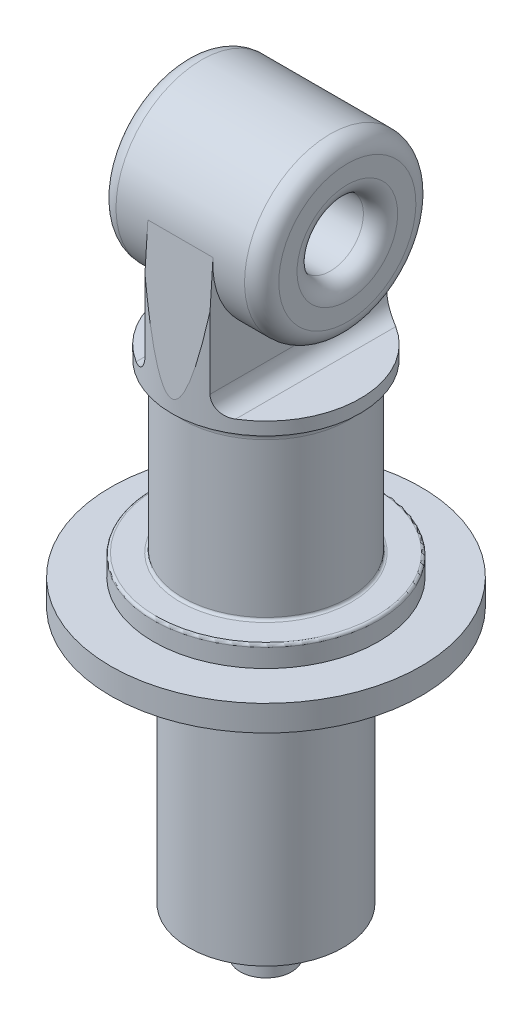
ISO-10303-21;
HEADER;
FILE_DESCRIPTION(('STEP AP214'),'2;1');
FILE_NAME('part.step','',(''),(''),'','','');
FILE_SCHEMA(('AUTOMOTIVE_DESIGN { 1 0 10303 214 1 1 1 1 }'));
ENDSEC;
DATA;
#1=APPLICATION_CONTEXT('core data for automotive mechanical design processes');
#2=APPLICATION_PROTOCOL_DEFINITION('international standard','automotive_design',2000,#1);
#3=PRODUCT_CONTEXT('',#1,'mechanical');
#4=PRODUCT('Part','Part','',(#3));
#5=PRODUCT_RELATED_PRODUCT_CATEGORY('part','',(#4));
#6=PRODUCT_DEFINITION_FORMATION('','',#4);
#7=PRODUCT_DEFINITION_CONTEXT('part definition',#1,'design');
#8=PRODUCT_DEFINITION('design','',#6,#7);
#9=PRODUCT_DEFINITION_SHAPE('','',#8);
#10=(LENGTH_UNIT() NAMED_UNIT(*) SI_UNIT(.MILLI.,.METRE.));
#11=(NAMED_UNIT(*) PLANE_ANGLE_UNIT() SI_UNIT($,.RADIAN.));
#12=(NAMED_UNIT(*) SI_UNIT($,.STERADIAN.) SOLID_ANGLE_UNIT());
#13=UNCERTAINTY_MEASURE_WITH_UNIT(LENGTH_MEASURE(1.E-05),#10,'distance_accuracy_value','');
#14=(GEOMETRIC_REPRESENTATION_CONTEXT(3) GLOBAL_UNCERTAINTY_ASSIGNED_CONTEXT((#13)) GLOBAL_UNIT_ASSIGNED_CONTEXT((#10,
#11,#12)) REPRESENTATION_CONTEXT('',''));
#15=CARTESIAN_POINT('',(0.,0.,0.));
#16=DIRECTION('',(0.,0.,1.));
#17=DIRECTION('',(1.,0.,0.));
#18=AXIS2_PLACEMENT_3D('',#15,#16,#17);
#19=CARTESIAN_POINT('',(6.35,19.8769042879992,12.6730513018171));
#20=DIRECTION('',(0.,-0.0651105738582061,-0.99787805526119));
#21=DIRECTION('',(0.,0.99787805526119,-0.0651105738582061));
#22=AXIS2_PLACEMENT_3D('',#19,#20,#21);
#23=PLANE('',#22);
#24=DIRECTION('',(0.,-0.99787805526119,0.0651105738582061));
#25=VECTOR('',#24,1.);
#26=CARTESIAN_POINT('',(-4.826,19.8769042879992,12.6730513018171));
#27=LINE('',#26,#25);
#28=CARTESIAN_POINT('',(-4.826,19.8769042879992,12.6730513018171));
#29=VERTEX_POINT('',#28);
#30=CARTESIAN_POINT('',(-4.826,13.1811355705445,13.109943706973));
#31=VERTEX_POINT('',#30);
#32=EDGE_CURVE('E11',#29,#31,#27,.T.);
#33=ORIENTED_EDGE('',*,*,#32,.T.);
#34=CARTESIAN_POINT('',(0.,214.102803983225,0.));
#35=DIRECTION('',(0.,-0.0651105738582061,-0.99787805526119));
#36=DIRECTION('',(0.,-0.99787805526119,0.0651105738582061));
#37=AXIS2_PLACEMENT_3D('',#34,#35,#36);
#38=ELLIPSE('',#37,214.558084381548,13.97);
#39=CARTESIAN_POINT('',(4.826,13.1811355705445,13.109943706973));
#40=VERTEX_POINT('',#39);
#41=EDGE_CURVE('E36',#40,#31,#38,.T.);
#42=ORIENTED_EDGE('',*,*,#41,.F.);
#43=DIRECTION('',(0.,0.99787805526119,-0.0651105738582061));
#44=VECTOR('',#43,1.);
#45=CARTESIAN_POINT('',(4.826,19.8769042879992,12.6730513018171));
#46=LINE('',#45,#44);
#47=CARTESIAN_POINT('',(4.826,19.8769042879992,12.6730513018171));
#48=VERTEX_POINT('',#47);
#49=EDGE_CURVE('E27',#40,#48,#46,.T.);
#50=ORIENTED_EDGE('',*,*,#49,.T.);
#51=DIRECTION('',(-1.,0.,0.));
#52=VECTOR('',#51,1.);
#53=CARTESIAN_POINT('',(4.826,19.8769042879992,12.6730513018171));
#54=LINE('',#53,#52);
#55=EDGE_CURVE('E122',#48,#29,#54,.T.);
#56=ORIENTED_EDGE('',*,*,#55,.T.);
#57=EDGE_LOOP('',(#33,#42,#50,#56));
#58=FACE_BOUND('',#57,.T.);
#59=ADVANCED_FACE('F16',(#58),#23,.F.);
#60=CARTESIAN_POINT('',(6.35,0.,-13.97));
#61=DIRECTION('',(0.,-0.0651105738582063,0.99787805526119));
#62=DIRECTION('',(0.,-0.99787805526119,-0.0651105738582063));
#63=AXIS2_PLACEMENT_3D('',#60,#61,#62);
#64=PLANE('',#63);
#65=DIRECTION('',(0.,-0.99787805526119,-0.0651105738582063));
#66=VECTOR('',#65,1.);
#67=CARTESIAN_POINT('',(4.826,0.,-13.97));
#68=LINE('',#67,#66);
#69=CARTESIAN_POINT('',(4.826,19.8769042879992,-12.6730513018171));
#70=VERTEX_POINT('',#69);
#71=CARTESIAN_POINT('',(4.826,13.1811355705446,-13.109943706973));
#72=VERTEX_POINT('',#71);
#73=EDGE_CURVE('E123',#70,#72,#68,.T.);
#74=ORIENTED_EDGE('',*,*,#73,.T.);
#75=CARTESIAN_POINT('',(0.,214.102803983225,0.));
#76=DIRECTION('',(0.,-0.0651105738582063,0.99787805526119));
#77=DIRECTION('',(0.,-0.99787805526119,-0.0651105738582063));
#78=AXIS2_PLACEMENT_3D('',#75,#76,#77);
#79=ELLIPSE('',#78,214.558084381547,13.97);
#80=CARTESIAN_POINT('',(-4.826,13.1811355705446,-13.109943706973));
#81=VERTEX_POINT('',#80);
#82=EDGE_CURVE('E468',#81,#72,#79,.T.);
#83=ORIENTED_EDGE('',*,*,#82,.F.);
#84=DIRECTION('',(0.,0.99787805526119,0.0651105738582063));
#85=VECTOR('',#84,1.);
#86=CARTESIAN_POINT('',(-4.826,0.,-13.97));
#87=LINE('',#86,#85);
#88=CARTESIAN_POINT('',(-4.826,19.8769042879992,-12.6730513018171));
#89=VERTEX_POINT('',#88);
#90=EDGE_CURVE('E115',#81,#89,#87,.T.);
#91=ORIENTED_EDGE('',*,*,#90,.T.);
#92=DIRECTION('',(-1.,0.,0.));
#93=VECTOR('',#92,1.);
#94=CARTESIAN_POINT('',(4.826,19.8769042879992,-12.6730513018171));
#95=LINE('',#94,#93);
#96=EDGE_CURVE('E132',#70,#89,#95,.T.);
#97=ORIENTED_EDGE('',*,*,#96,.F.);
#98=EDGE_LOOP('',(#74,#83,#91,#97));
#99=FACE_BOUND('',#98,.T.);
#100=ADVANCED_FACE('F235',(#99),#64,.F.);
#101=CARTESIAN_POINT('',(4.826,0.,0.));
#102=DIRECTION('',(-1.,0.,0.));
#103=DIRECTION('',(0.,0.,1.));
#104=AXIS2_PLACEMENT_3D('',#101,#102,#103);
#105=PLANE('',#104);
#106=DIRECTION('',(0.,-1.,0.));
#107=VECTOR('',#106,1.);
#108=CARTESIAN_POINT('',(4.826,15.748,13.109943706973));
#109=LINE('',#108,#107);
#110=CARTESIAN_POINT('',(4.826,2.54,13.109943706973));
#111=VERTEX_POINT('',#110);
#112=EDGE_CURVE('E140',#111,#40,#109,.F.);
#113=ORIENTED_EDGE('',*,*,#112,.F.);
#114=DIRECTION('',(0.,0.,-1.));
#115=VECTOR('',#114,1.);
#116=CARTESIAN_POINT('',(4.826,2.54,-13.109943706973));
#117=LINE('',#116,#115);
#118=CARTESIAN_POINT('',(4.826,2.54,-13.109943706973));
#119=VERTEX_POINT('',#118);
#120=EDGE_CURVE('E113',#111,#119,#117,.T.);
#121=ORIENTED_EDGE('',*,*,#120,.T.);
#122=DIRECTION('',(0.,-1.,0.));
#123=VECTOR('',#122,1.);
#124=CARTESIAN_POINT('',(4.826,15.748,-13.109943706973));
#125=LINE('',#124,#123);
#126=EDGE_CURVE('E91',#72,#119,#125,.T.);
#127=ORIENTED_EDGE('',*,*,#126,.F.);
#128=ORIENTED_EDGE('',*,*,#73,.F.);
#129=CARTESIAN_POINT('',(4.826,19.05,0.));
#130=DIRECTION('',(-1.,0.,0.));
#131=DIRECTION('',(0.,0.,1.));
#132=AXIS2_PLACEMENT_3D('',#129,#130,#131);
#133=CIRCLE('',#132,12.7);
#134=EDGE_CURVE('E100',#48,#70,#133,.F.);
#135=ORIENTED_EDGE('',*,*,#134,.F.);
#136=ORIENTED_EDGE('',*,*,#49,.F.);
#137=EDGE_LOOP('',(#113,#121,#127,#128,#135,#136));
#138=FACE_BOUND('',#137,.T.);
#139=ADVANCED_FACE('F241',(#138),#105,.F.);
#140=CARTESIAN_POINT('',(-4.826,0.,0.));
#141=DIRECTION('',(1.,0.,0.));
#142=DIRECTION('',(0.,0.,-1.));
#143=AXIS2_PLACEMENT_3D('',#140,#141,#142);
#144=PLANE('',#143);
#145=DIRECTION('',(0.,-1.,0.));
#146=VECTOR('',#145,1.);
#147=CARTESIAN_POINT('',(-4.826,15.748,-13.109943706973));
#148=LINE('',#147,#146);
#149=CARTESIAN_POINT('',(-4.826,2.54,-13.109943706973));
#150=VERTEX_POINT('',#149);
#151=EDGE_CURVE('E474',#150,#81,#148,.F.);
#152=ORIENTED_EDGE('',*,*,#151,.F.);
#153=DIRECTION('',(0.,0.,1.));
#154=VECTOR('',#153,1.);
#155=CARTESIAN_POINT('',(-4.826,2.54,13.109943706973));
#156=LINE('',#155,#154);
#157=CARTESIAN_POINT('',(-4.826,2.54,13.109943706973));
#158=VERTEX_POINT('',#157);
#159=EDGE_CURVE('E116',#150,#158,#156,.T.);
#160=ORIENTED_EDGE('',*,*,#159,.T.);
#161=DIRECTION('',(0.,-1.,0.));
#162=VECTOR('',#161,1.);
#163=CARTESIAN_POINT('',(-4.826,15.748,13.109943706973));
#164=LINE('',#163,#162);
#165=EDGE_CURVE('E472',#31,#158,#164,.T.);
#166=ORIENTED_EDGE('',*,*,#165,.F.);
#167=ORIENTED_EDGE('',*,*,#32,.F.);
#168=CARTESIAN_POINT('',(-4.826,19.05,0.));
#169=DIRECTION('',(1.,0.,0.));
#170=DIRECTION('',(0.,0.,-1.));
#171=AXIS2_PLACEMENT_3D('',#168,#169,#170);
#172=CIRCLE('',#171,12.7);
#173=EDGE_CURVE('E118',#29,#89,#172,.T.);
#174=ORIENTED_EDGE('',*,*,#173,.T.);
#175=ORIENTED_EDGE('',*,*,#90,.F.);
#176=EDGE_LOOP('',(#152,#160,#166,#167,#174,#175));
#177=FACE_BOUND('',#176,.T.);
#178=ADVANCED_FACE('F247',(#177),#144,.F.);
#179=CARTESIAN_POINT('',(6.35,19.05,0.));
#180=DIRECTION('',(-1.,0.,0.));
#181=DIRECTION('',(0.,0.,1.));
#182=AXIS2_PLACEMENT_3D('',#179,#180,#181);
#183=CYLINDRICAL_SURFACE('',#182,12.7);
#184=CARTESIAN_POINT('',(-9.525,19.05,0.));
#185=DIRECTION('',(1.,0.,0.));
#186=DIRECTION('',(0.,1.,0.));
#187=AXIS2_PLACEMENT_3D('',#184,#185,#186);
#188=CIRCLE('',#187,12.7);
#189=CARTESIAN_POINT('',(-9.525,31.75,0.));
#190=VERTEX_POINT('',#189);
#191=EDGE_CURVE('E130',#190,#190,#188,.T.);
#192=ORIENTED_EDGE('',*,*,#191,.T.);
#193=EDGE_LOOP('',(#192));
#194=FACE_BOUND('',#193,.T.);
#195=CARTESIAN_POINT('',(9.525,19.05,0.));
#196=DIRECTION('',(-1.,0.,0.));
#197=DIRECTION('',(0.,1.,0.));
#198=AXIS2_PLACEMENT_3D('',#195,#196,#197);
#199=CIRCLE('',#198,12.7);
#200=CARTESIAN_POINT('',(9.525,31.75,0.));
#201=VERTEX_POINT('',#200);
#202=EDGE_CURVE('E309',#201,#201,#199,.T.);
#203=ORIENTED_EDGE('',*,*,#202,.T.);
#204=EDGE_LOOP('',(#203));
#205=FACE_BOUND('',#204,.T.);
#206=ORIENTED_EDGE('',*,*,#96,.T.);
#207=ORIENTED_EDGE('',*,*,#173,.F.);
#208=ORIENTED_EDGE('',*,*,#55,.F.);
#209=ORIENTED_EDGE('',*,*,#134,.T.);
#210=EDGE_LOOP('',(#206,#207,#208,#209));
#211=FACE_BOUND('',#210,.T.);
#212=ADVANCED_FACE('F251',(#194,#205,#211),#183,.T.);
#213=CARTESIAN_POINT('',(0.,15.748,0.));
#214=DIRECTION('',(0.,-1.,0.));
#215=DIRECTION('',(0.,0.,-1.));
#216=AXIS2_PLACEMENT_3D('',#213,#214,#215);
#217=CYLINDRICAL_SURFACE('',#216,13.97);
#218=CARTESIAN_POINT('',(0.,0.,0.));
#219=DIRECTION('',(0.,-1.,0.));
#220=DIRECTION('',(0.,0.,-1.));
#221=AXIS2_PLACEMENT_3D('',#218,#219,#220);
#222=CIRCLE('',#221,13.97);
#223=CARTESIAN_POINT('',(7.366,0.,-11.8702545886767));
#224=VERTEX_POINT('',#223);
#225=CARTESIAN_POINT('',(7.366,0.,11.8702545886767));
#226=VERTEX_POINT('',#225);
#227=EDGE_CURVE('E88',#224,#226,#222,.T.);
#228=ORIENTED_EDGE('',*,*,#227,.T.);
#229=CARTESIAN_POINT('',(7.366,0.,11.8702545886767));
#230=CARTESIAN_POINT('',(7.29181148732094,-1.63932955825946E-06,11.916300052829));
#231=CARTESIAN_POINT('',(7.21716949553526,0.00325129115652927,11.9616469271108));
#232=CARTESIAN_POINT('',(7.06744615251427,0.0164871298823342,12.0507114685733));
#233=CARTESIAN_POINT('',(6.99236453841571,0.0264745854219542,12.0944280138581));
#234=CARTESIAN_POINT('',(6.84191003256335,0.0534764963886179,12.1801769753418));
#235=CARTESIAN_POINT('',(6.76653787238625,0.0705300924146333,12.2221985572028));
#236=CARTESIAN_POINT('',(6.61660420501369,0.111819215576661,12.3040141167367));
#237=CARTESIAN_POINT('',(6.54204253670372,0.136053287229985,12.3438085439125));
#238=CARTESIAN_POINT('',(6.31989402985319,0.22001498158816,12.4598416883741));
#239=CARTESIAN_POINT('',(6.17438820099671,0.290908663737457,12.532421677843));
#240=CARTESIAN_POINT('',(5.89624162372782,0.462024306563565,12.665663474627));
#241=CARTESIAN_POINT('',(5.76356587188866,0.562163291343938,12.7263582003483));
#242=CARTESIAN_POINT('',(5.53193064516208,0.776551636755455,12.8285940357882));
#243=CARTESIAN_POINT('',(5.43084689437194,0.887835690047818,12.8715376612065));
#244=CARTESIAN_POINT('',(5.24861889972273,1.128936193313,12.9469171801795));
#245=CARTESIAN_POINT('',(5.16747934341325,1.25875698872425,12.9793506040563));
#246=CARTESIAN_POINT('',(5.03560164763056,1.52005164610389,13.0310469336872));
#247=CARTESIAN_POINT('',(4.98276059104392,1.6502865298767,13.0512436375013));
#248=CARTESIAN_POINT('',(4.89920541071359,1.91856475649422,13.0828403875511));
#249=CARTESIAN_POINT('',(4.86845407450571,2.05659454277938,13.0942552300735));
#250=CARTESIAN_POINT('',(4.84158336018741,2.25321269836794,13.1041985137456));
#251=CARTESIAN_POINT('',(4.83573940878378,2.31044132738489,13.1063551036091));
#252=CARTESIAN_POINT('',(4.82795210654026,2.42510382660447,13.1092255002388));
#253=CARTESIAN_POINT('',(4.82600228921297,2.48253719763396,13.1099416988912));
#254=CARTESIAN_POINT('',(4.826,2.54,13.109943706973));
#255=B_SPLINE_CURVE_WITH_KNOTS('',3,(#229,#230,#231,#232,#233,#234,#235,#236,#237,#238,#239,
#240,#241,#242,#243,#244,#245,#246,#247,#248,#249,#250,#251,#252,#253,#254),.UNSPECIFIED.,.F.,
.F.,(4,2,2,2,2,2,2,2,2,2,2,2,4),(0.,0.261907698258498,0.523992419696999,0.787548704447545,
1.0510516028336,1.57992982738228,2.1073218391785,2.57380460756582,3.04039691031993,
3.46428077088171,3.88744886898215,4.06002797080371,4.23232025364326),.UNSPECIFIED.);
#256=EDGE_CURVE('E101',#226,#111,#255,.T.);
#257=ORIENTED_EDGE('',*,*,#256,.T.);
#258=ORIENTED_EDGE('',*,*,#112,.T.);
#259=ORIENTED_EDGE('',*,*,#41,.T.);
#260=ORIENTED_EDGE('',*,*,#165,.T.);
#261=CARTESIAN_POINT('',(-4.826,2.54,13.109943706973));
#262=CARTESIAN_POINT('',(-4.82599122508925,2.4722657284341,13.1099429539883));
#263=CARTESIAN_POINT('',(-4.8287092819113,2.4045352187035,13.1089462696935));
#264=CARTESIAN_POINT('',(-4.83953209224296,2.269572453512,13.1049566968555));
#265=CARTESIAN_POINT('',(-4.84763624738624,2.20234014354265,13.1019640300551));
#266=CARTESIAN_POINT('',(-4.86914436895884,2.0689729287174,13.0939855515035));
#267=CARTESIAN_POINT('',(-4.88253848677868,2.00283622118225,13.089003443413));
#268=CARTESIAN_POINT('',(-4.91448073950523,1.87202280655524,13.0770435312841));
#269=CARTESIAN_POINT('',(-4.93302886469556,1.80734609671122,13.070065731008));
#270=CARTESIAN_POINT('',(-4.99617022898312,1.61616505991883,13.0461196989429));
#271=CARTESIAN_POINT('',(-5.04827609041726,1.49241420169571,13.026133227193));
#272=CARTESIAN_POINT('',(-5.17044296387841,1.25591362743398,12.9781237489745));
#273=CARTESIAN_POINT('',(-5.24050593954779,1.14316511638453,12.9500998635607));
#274=CARTESIAN_POINT('',(-5.39716851073837,0.929693044407794,12.8856018546393));
#275=CARTESIAN_POINT('',(-5.48400706411973,0.829182388772133,12.849003763374));
#276=CARTESIAN_POINT('',(-5.67026149077555,0.644401425374744,12.7679026268879));
#277=CARTESIAN_POINT('',(-5.76967681471278,0.560130408691819,12.7233999268959));
#278=CARTESIAN_POINT('',(-5.98328681366751,0.405044096502958,12.6244102384108));
#279=CARTESIAN_POINT('',(-6.09798697841567,0.335186353608236,12.5695172910097));
#280=CARTESIAN_POINT('',(-6.33392416930834,0.215355470671155,12.4522968977487));
#281=CARTESIAN_POINT('',(-6.45516996124936,0.165409786178095,12.3899593397127));
#282=CARTESIAN_POINT('',(-6.70834087985297,0.0827888252805763,12.2548302015695));
#283=CARTESIAN_POINT('',(-6.84046161766104,0.0513786632767545,12.1816298246007));
#284=CARTESIAN_POINT('',(-7.03832202124209,0.0203404086022064,12.0676733945036));
#285=CARTESIAN_POINT('',(-7.10414928773925,0.0126734494028344,12.0290403657894));
#286=CARTESIAN_POINT('',(-7.23542368449797,0.00250660916114053,11.9505394256257));
#287=CARTESIAN_POINT('',(-7.30087098648267,4.17745203811172E-06,11.9106721336364));
#288=CARTESIAN_POINT('',(-7.366,0.,11.8702545886767));
#289=B_SPLINE_CURVE_WITH_KNOTS('',3,(#261,#262,#263,#264,#265,#266,#267,#268,#269,#270,#271,
#272,#273,#274,#275,#276,#277,#278,#279,#280,#281,#282,#283,#284,#285,#286,#287,#288),
.UNSPECIFIED.,.F.,.F.,(4,2,2,2,2,2,2,2,2,2,2,2,2,4),(0.,0.203134367448511,0.406246171541174,
0.6089816005949,0.811716647452572,1.21689925542543,1.62212618975494,2.03361927425091,
2.44509439145793,2.87851869661511,3.3125385747422,3.77351129107891,4.00348864308186,
4.23335238622009),.UNSPECIFIED.);
#290=CARTESIAN_POINT('',(-7.366,0.,11.8702545886767));
#291=VERTEX_POINT('',#290);
#292=EDGE_CURVE('E488',#158,#291,#289,.T.);
#293=ORIENTED_EDGE('',*,*,#292,.T.);
#294=CARTESIAN_POINT('',(0.,0.,0.));
#295=DIRECTION('',(0.,-1.,0.));
#296=DIRECTION('',(0.,0.,-1.));
#297=AXIS2_PLACEMENT_3D('',#294,#295,#296);
#298=CIRCLE('',#297,13.97);
#299=CARTESIAN_POINT('',(-7.366,0.,-11.8702545886767));
#300=VERTEX_POINT('',#299);
#301=EDGE_CURVE('E483',#291,#300,#298,.T.);
#302=ORIENTED_EDGE('',*,*,#301,.T.);
#303=CARTESIAN_POINT('',(-7.366,0.,-11.8702545886767));
#304=CARTESIAN_POINT('',(-7.29181148732094,-1.63932955825946E-06,-11.916300052829));
#305=CARTESIAN_POINT('',(-7.21716949553526,0.00325129115652927,-11.9616469271108));
#306=CARTESIAN_POINT('',(-7.06744615251427,0.0164871298823342,-12.0507114685733));
#307=CARTESIAN_POINT('',(-6.99236453841571,0.0264745854219542,-12.0944280138581));
#308=CARTESIAN_POINT('',(-6.84191003256335,0.0534764963886179,-12.1801769753418));
#309=CARTESIAN_POINT('',(-6.76653787238625,0.0705300924146333,-12.2221985572028));
#310=CARTESIAN_POINT('',(-6.61660420501369,0.111819215576661,-12.3040141167367));
#311=CARTESIAN_POINT('',(-6.54204253670372,0.136053287229985,-12.3438085439125));
#312=CARTESIAN_POINT('',(-6.31989402985319,0.22001498158816,-12.4598416883741));
#313=CARTESIAN_POINT('',(-6.17438820099671,0.290908663737457,-12.532421677843));
#314=CARTESIAN_POINT('',(-5.89624162372782,0.462024306563565,-12.665663474627));
#315=CARTESIAN_POINT('',(-5.76356587188866,0.562163291343938,-12.7263582003483));
#316=CARTESIAN_POINT('',(-5.53193064516208,0.776551636755455,-12.8285940357882));
#317=CARTESIAN_POINT('',(-5.43084689437194,0.887835690047818,-12.8715376612065));
#318=CARTESIAN_POINT('',(-5.24861889972273,1.128936193313,-12.9469171801795));
#319=CARTESIAN_POINT('',(-5.16747934341325,1.25875698872425,-12.9793506040563));
#320=CARTESIAN_POINT('',(-5.03560164763056,1.52005164610389,-13.0310469336872));
#321=CARTESIAN_POINT('',(-4.98276059104392,1.6502865298767,-13.0512436375013));
#322=CARTESIAN_POINT('',(-4.89920541071359,1.91856475649422,-13.0828403875511));
#323=CARTESIAN_POINT('',(-4.86845407450571,2.05659454277938,-13.0942552300735));
#324=CARTESIAN_POINT('',(-4.84158336018741,2.25321269836794,-13.1041985137456));
#325=CARTESIAN_POINT('',(-4.83573940878378,2.31044132738489,-13.1063551036091));
#326=CARTESIAN_POINT('',(-4.82795210654026,2.42510382660447,-13.1092255002388));
#327=CARTESIAN_POINT('',(-4.82600228921297,2.48253719763396,-13.1099416988912));
#328=CARTESIAN_POINT('',(-4.826,2.54,-13.109943706973));
#329=B_SPLINE_CURVE_WITH_KNOTS('',3,(#303,#304,#305,#306,#307,#308,#309,#310,#311,#312,#313,
#314,#315,#316,#317,#318,#319,#320,#321,#322,#323,#324,#325,#326,#327,#328),.UNSPECIFIED.,.F.,
.F.,(4,2,2,2,2,2,2,2,2,2,2,2,4),(0.,0.261907698258498,0.523992419696999,0.787548704447545,
1.0510516028336,1.57992982738228,2.1073218391785,2.57380460756582,3.04039691031993,
3.46428077088171,3.88744886898215,4.06002797080371,4.23232025364326),.UNSPECIFIED.);
#330=EDGE_CURVE('E79',#300,#150,#329,.T.);
#331=ORIENTED_EDGE('',*,*,#330,.T.);
#332=ORIENTED_EDGE('',*,*,#151,.T.);
#333=ORIENTED_EDGE('',*,*,#82,.T.);
#334=ORIENTED_EDGE('',*,*,#126,.T.);
#335=CARTESIAN_POINT('',(4.826,2.54,-13.109943706973));
#336=CARTESIAN_POINT('',(4.82599122508925,2.4722657284341,-13.1099429539883));
#337=CARTESIAN_POINT('',(4.8287092819113,2.4045352187035,-13.1089462696935));
#338=CARTESIAN_POINT('',(4.83953209224296,2.269572453512,-13.1049566968555));
#339=CARTESIAN_POINT('',(4.84763624738624,2.20234014354265,-13.1019640300551));
#340=CARTESIAN_POINT('',(4.86914436895884,2.0689729287174,-13.0939855515035));
#341=CARTESIAN_POINT('',(4.88253848677868,2.00283622118225,-13.089003443413));
#342=CARTESIAN_POINT('',(4.91448073950523,1.87202280655524,-13.0770435312841));
#343=CARTESIAN_POINT('',(4.93302886469556,1.80734609671122,-13.070065731008));
#344=CARTESIAN_POINT('',(4.99617022898312,1.61616505991883,-13.0461196989429));
#345=CARTESIAN_POINT('',(5.04827609041726,1.49241420169571,-13.026133227193));
#346=CARTESIAN_POINT('',(5.17044296387841,1.25591362743398,-12.9781237489745));
#347=CARTESIAN_POINT('',(5.24050593954779,1.14316511638453,-12.9500998635607));
#348=CARTESIAN_POINT('',(5.39716851073837,0.929693044407794,-12.8856018546393));
#349=CARTESIAN_POINT('',(5.48400706411973,0.829182388772133,-12.849003763374));
#350=CARTESIAN_POINT('',(5.67026149077555,0.644401425374744,-12.7679026268879));
#351=CARTESIAN_POINT('',(5.76967681471278,0.560130408691819,-12.7233999268959));
#352=CARTESIAN_POINT('',(5.98328681366751,0.405044096502958,-12.6244102384108));
#353=CARTESIAN_POINT('',(6.09798697841567,0.335186353608236,-12.5695172910097));
#354=CARTESIAN_POINT('',(6.33392416930834,0.215355470671155,-12.4522968977487));
#355=CARTESIAN_POINT('',(6.45516996124936,0.165409786178095,-12.3899593397127));
#356=CARTESIAN_POINT('',(6.70834087985297,0.0827888252805763,-12.2548302015695));
#357=CARTESIAN_POINT('',(6.84046161766104,0.0513786632767545,-12.1816298246007));
#358=CARTESIAN_POINT('',(7.03832202124209,0.0203404086022064,-12.0676733945036));
#359=CARTESIAN_POINT('',(7.10414928773925,0.0126734494028344,-12.0290403657894));
#360=CARTESIAN_POINT('',(7.23542368449797,0.00250660916114053,-11.9505394256257));
#361=CARTESIAN_POINT('',(7.30087098648267,4.17745203811172E-06,-11.9106721336364));
#362=CARTESIAN_POINT('',(7.366,0.,-11.8702545886767));
#363=B_SPLINE_CURVE_WITH_KNOTS('',3,(#335,#336,#337,#338,#339,#340,#341,#342,#343,#344,#345,
#346,#347,#348,#349,#350,#351,#352,#353,#354,#355,#356,#357,#358,#359,#360,#361,#362),
.UNSPECIFIED.,.F.,.F.,(4,2,2,2,2,2,2,2,2,2,2,2,2,4),(0.,0.203134367448511,0.406246171541174,
0.6089816005949,0.811716647452572,1.21689925542543,1.62212618975494,2.03361927425091,
2.44509439145793,2.87851869661511,3.3125385747422,3.77351129107891,4.00348864308186,
4.23335238622009),.UNSPECIFIED.);
#364=EDGE_CURVE('E84',#119,#224,#363,.T.);
#365=ORIENTED_EDGE('',*,*,#364,.T.);
#366=EDGE_LOOP('',(#228,#257,#258,#259,#260,#293,#302,#331,#332,#333,#334,#365));
#367=FACE_BOUND('',#366,.T.);
#368=CARTESIAN_POINT('',(0.,-1.905,0.));
#369=DIRECTION('',(0.,-1.,0.));
#370=DIRECTION('',(0.,0.,-1.));
#371=AXIS2_PLACEMENT_3D('',#368,#369,#370);
#372=CIRCLE('',#371,13.97);
#373=CARTESIAN_POINT('',(0.,-1.905,-13.97));
#374=VERTEX_POINT('',#373);
#375=EDGE_CURVE('E174',#374,#374,#372,.T.);
#376=ORIENTED_EDGE('',*,*,#375,.F.);
#377=EDGE_LOOP('',(#376));
#378=FACE_BOUND('',#377,.T.);
#379=ADVANCED_FACE('F18',(#367,#378),#217,.T.);
#380=CARTESIAN_POINT('',(0.,0.,0.));
#381=DIRECTION('',(0.,-1.,0.));
#382=DIRECTION('',(0.,0.,-1.));
#383=AXIS2_PLACEMENT_3D('',#380,#381,#382);
#384=PLANE('',#383);
#385=ORIENTED_EDGE('',*,*,#227,.F.);
#386=DIRECTION('',(0.,0.,1.));
#387=VECTOR('',#386,1.);
#388=CARTESIAN_POINT('',(7.366,0.,-11.8702545886767));
#389=LINE('',#388,#387);
#390=EDGE_CURVE('E96',#224,#226,#389,.T.);
#391=ORIENTED_EDGE('',*,*,#390,.T.);
#392=EDGE_LOOP('',(#385,#391));
#393=FACE_BOUND('',#392,.T.);
#394=ADVANCED_FACE('F99',(#393),#384,.F.);
#395=CARTESIAN_POINT('',(0.,0.,0.));
#396=DIRECTION('',(0.,-1.,0.));
#397=DIRECTION('',(0.,0.,-1.));
#398=AXIS2_PLACEMENT_3D('',#395,#396,#397);
#399=PLANE('',#398);
#400=ORIENTED_EDGE('',*,*,#301,.F.);
#401=DIRECTION('',(0.,0.,-1.));
#402=VECTOR('',#401,1.);
#403=CARTESIAN_POINT('',(-7.366,0.,11.8702545886767));
#404=LINE('',#403,#402);
#405=EDGE_CURVE('E104',#291,#300,#404,.T.);
#406=ORIENTED_EDGE('',*,*,#405,.T.);
#407=EDGE_LOOP('',(#400,#406));
#408=FACE_BOUND('',#407,.T.);
#409=ADVANCED_FACE('F147',(#408),#399,.F.);
#410=CARTESIAN_POINT('',(7.366,2.54,0.));
#411=DIRECTION('',(0.,0.,-1.));
#412=DIRECTION('',(0.,-1.,0.));
#413=AXIS2_PLACEMENT_3D('',#410,#411,#412);
#414=CYLINDRICAL_SURFACE('',#413,2.54);
#415=ORIENTED_EDGE('',*,*,#364,.F.);
#416=ORIENTED_EDGE('',*,*,#120,.F.);
#417=ORIENTED_EDGE('',*,*,#256,.F.);
#418=ORIENTED_EDGE('',*,*,#390,.F.);
#419=EDGE_LOOP('',(#415,#416,#417,#418));
#420=FACE_BOUND('',#419,.T.);
#421=ADVANCED_FACE('F103',(#420),#414,.F.);
#422=CARTESIAN_POINT('',(-7.366,2.54,0.));
#423=DIRECTION('',(0.,0.,1.));
#424=DIRECTION('',(1.,0.,0.));
#425=AXIS2_PLACEMENT_3D('',#422,#423,#424);
#426=CYLINDRICAL_SURFACE('',#425,2.54);
#427=ORIENTED_EDGE('',*,*,#292,.F.);
#428=ORIENTED_EDGE('',*,*,#159,.F.);
#429=ORIENTED_EDGE('',*,*,#330,.F.);
#430=ORIENTED_EDGE('',*,*,#405,.F.);
#431=EDGE_LOOP('',(#427,#428,#429,#430));
#432=FACE_BOUND('',#431,.T.);
#433=ADVANCED_FACE('F146',(#432),#426,.F.);
#434=CARTESIAN_POINT('',(0.,-26.7444577770875,0.));
#435=DIRECTION('',(0.,1.,0.));
#436=DIRECTION('',(0.,0.,1.));
#437=AXIS2_PLACEMENT_3D('',#434,#435,#436);
#438=PLANE('',#437);
#439=CARTESIAN_POINT('',(0.,-26.7444577770875,0.));
#440=DIRECTION('',(0.,1.,0.));
#441=DIRECTION('',(1.,0.,0.));
#442=AXIS2_PLACEMENT_3D('',#439,#440,#441);
#443=CIRCLE('',#442,16.3066049944422);
#444=CARTESIAN_POINT('',(16.3066049944422,-26.7444577770875,0.));
#445=VERTEX_POINT('',#444);
#446=EDGE_CURVE('E107',#445,#445,#443,.T.);
#447=ORIENTED_EDGE('',*,*,#446,.T.);
#448=EDGE_LOOP('',(#447));
#449=FACE_BOUND('',#448,.T.);
#450=CARTESIAN_POINT('',(0.,-26.7444577770875,0.));
#451=DIRECTION('',(0.,-1.,0.));
#452=DIRECTION('',(1.,0.,0.));
#453=AXIS2_PLACEMENT_3D('',#450,#451,#452);
#454=CIRCLE('',#453,12.7086545882559);
#455=CARTESIAN_POINT('',(12.7086545882559,-26.7444577770875,0.));
#456=VERTEX_POINT('',#455);
#457=EDGE_CURVE('E318',#456,#456,#454,.T.);
#458=ORIENTED_EDGE('',*,*,#457,.T.);
#459=EDGE_LOOP('',(#458));
#460=FACE_BOUND('',#459,.T.);
#461=ADVANCED_FACE('F258',(#449,#460),#438,.T.);
#462=CARTESIAN_POINT('',(0.,-1.905,0.));
#463=DIRECTION('',(0.,1.,0.));
#464=DIRECTION('',(1.,0.,0.));
#465=AXIS2_PLACEMENT_3D('',#462,#463,#464);
#466=CYLINDRICAL_SURFACE('',#465,12.3276545882559);
#467=CARTESIAN_POINT('',(0.,-26.3634577770875,0.));
#468=DIRECTION('',(0.,1.,0.));
#469=DIRECTION('',(1.,0.,0.));
#470=AXIS2_PLACEMENT_3D('',#467,#468,#469);
#471=CIRCLE('',#470,12.3276545882559);
#472=CARTESIAN_POINT('',(12.3276545882559,-26.3634577770875,0.));
#473=VERTEX_POINT('',#472);
#474=EDGE_CURVE('E321',#473,#473,#471,.T.);
#475=ORIENTED_EDGE('',*,*,#474,.T.);
#476=EDGE_LOOP('',(#475));
#477=FACE_BOUND('',#476,.T.);
#478=CARTESIAN_POINT('',(0.,-3.55597731604711,0.));
#479=DIRECTION('',(0.,-1.,0.));
#480=DIRECTION('',(1.,0.,0.));
#481=AXIS2_PLACEMENT_3D('',#478,#479,#480);
#482=CIRCLE('',#481,12.3276545882559);
#483=CARTESIAN_POINT('',(12.3276545882559,-3.55597731604711,0.));
#484=VERTEX_POINT('',#483);
#485=EDGE_CURVE('E163',#484,#484,#482,.T.);
#486=ORIENTED_EDGE('',*,*,#485,.T.);
#487=EDGE_LOOP('',(#486));
#488=FACE_BOUND('',#487,.T.);
#489=ADVANCED_FACE('F261',(#477,#488),#466,.T.);
#490=CARTESIAN_POINT('',(0.,-33.655,0.));
#491=DIRECTION('',(0.,1.,0.));
#492=DIRECTION('',(0.,0.,1.));
#493=AXIS2_PLACEMENT_3D('',#490,#491,#492);
#494=PLANE('',#493);
#495=CARTESIAN_POINT('',(0.,-33.655,0.));
#496=DIRECTION('',(0.,1.,0.));
#497=DIRECTION('',(0.,0.,1.));
#498=AXIS2_PLACEMENT_3D('',#495,#496,#497);
#499=CIRCLE('',#498,22.999999974);
#500=CARTESIAN_POINT('',(0.,-33.655,22.999999974));
#501=VERTEX_POINT('',#500);
#502=EDGE_CURVE('E164',#501,#501,#499,.T.);
#503=ORIENTED_EDGE('',*,*,#502,.F.);
#504=EDGE_LOOP('',(#503));
#505=FACE_BOUND('',#504,.T.);
#506=CARTESIAN_POINT('',(0.,-33.655,0.));
#507=DIRECTION('',(0.,1.,0.));
#508=DIRECTION('',(0.,0.,1.));
#509=AXIS2_PLACEMENT_3D('',#506,#507,#508);
#510=CIRCLE('',#509,11.43);
#511=CARTESIAN_POINT('',(0.,-33.655,11.43));
#512=VERTEX_POINT('',#511);
#513=EDGE_CURVE('E160',#512,#512,#510,.T.);
#514=ORIENTED_EDGE('',*,*,#513,.T.);
#515=EDGE_LOOP('',(#514));
#516=FACE_BOUND('',#515,.T.);
#517=ADVANCED_FACE('F263',(#505,#516),#494,.F.);
#518=CARTESIAN_POINT('',(0.,-1.905,0.));
#519=DIRECTION('',(0.,1.,0.));
#520=DIRECTION('',(1.,0.,0.));
#521=AXIS2_PLACEMENT_3D('',#518,#519,#520);
#522=CYLINDRICAL_SURFACE('',#521,22.999999974);
#523=ORIENTED_EDGE('',*,*,#502,.T.);
#524=EDGE_LOOP('',(#523));
#525=FACE_BOUND('',#524,.T.);
#526=CARTESIAN_POINT('',(0.,-29.845,0.));
#527=DIRECTION('',(0.,1.,0.));
#528=DIRECTION('',(0.,0.,1.));
#529=AXIS2_PLACEMENT_3D('',#526,#527,#528);
#530=CIRCLE('',#529,22.999999974);
#531=CARTESIAN_POINT('',(0.,-29.845,22.999999974));
#532=VERTEX_POINT('',#531);
#533=EDGE_CURVE('E167',#532,#532,#530,.T.);
#534=ORIENTED_EDGE('',*,*,#533,.F.);
#535=EDGE_LOOP('',(#534));
#536=FACE_BOUND('',#535,.T.);
#537=ADVANCED_FACE('F266',(#525,#536),#522,.T.);
#538=CARTESIAN_POINT('',(0.,-29.845,0.));
#539=DIRECTION('',(0.,1.,0.));
#540=DIRECTION('',(0.,0.,1.));
#541=AXIS2_PLACEMENT_3D('',#538,#539,#540);
#542=PLANE('',#541);
#543=ORIENTED_EDGE('',*,*,#533,.T.);
#544=EDGE_LOOP('',(#543));
#545=FACE_BOUND('',#544,.T.);
#546=CARTESIAN_POINT('',(0.,-29.845,0.));
#547=DIRECTION('',(0.,1.,0.));
#548=DIRECTION('',(0.,0.,1.));
#549=AXIS2_PLACEMENT_3D('',#546,#547,#548);
#550=CIRCLE('',#549,16.6876049944422);
#551=CARTESIAN_POINT('',(0.,-29.845,16.6876049944422));
#552=VERTEX_POINT('',#551);
#553=EDGE_CURVE('E171',#552,#552,#550,.T.);
#554=ORIENTED_EDGE('',*,*,#553,.F.);
#555=EDGE_LOOP('',(#554));
#556=FACE_BOUND('',#555,.T.);
#557=ADVANCED_FACE('F268',(#545,#556),#542,.T.);
#558=CARTESIAN_POINT('',(0.,-1.905,0.));
#559=DIRECTION('',(0.,1.,0.));
#560=DIRECTION('',(1.,0.,0.));
#561=AXIS2_PLACEMENT_3D('',#558,#559,#560);
#562=CYLINDRICAL_SURFACE('',#561,16.6876049944422);
#563=CARTESIAN_POINT('',(0.,-27.1254577770875,0.));
#564=DIRECTION('',(0.,-1.,0.));
#565=DIRECTION('',(1.,0.,0.));
#566=AXIS2_PLACEMENT_3D('',#563,#564,#565);
#567=CIRCLE('',#566,16.6876049944422);
#568=CARTESIAN_POINT('',(16.6876049944422,-27.1254577770875,0.));
#569=VERTEX_POINT('',#568);
#570=EDGE_CURVE('E170',#569,#569,#567,.T.);
#571=ORIENTED_EDGE('',*,*,#570,.T.);
#572=EDGE_LOOP('',(#571));
#573=FACE_BOUND('',#572,.T.);
#574=ORIENTED_EDGE('',*,*,#553,.T.);
#575=EDGE_LOOP('',(#574));
#576=FACE_BOUND('',#575,.T.);
#577=ADVANCED_FACE('F148',(#573,#576),#562,.T.);
#578=CARTESIAN_POINT('',(0.,-3.55597731604711,0.));
#579=DIRECTION('',(0.,1.,0.));
#580=DIRECTION('',(1.,0.,0.));
#581=AXIS2_PLACEMENT_3D('',#578,#579,#580);
#582=TOROIDAL_SURFACE('',#581,13.9786545882559,1.651);
#583=ORIENTED_EDGE('',*,*,#485,.F.);
#584=EDGE_LOOP('',(#583));
#585=FACE_BOUND('',#584,.T.);
#586=ORIENTED_EDGE('',*,*,#375,.T.);
#587=EDGE_LOOP('',(#586));
#588=FACE_BOUND('',#587,.T.);
#589=ADVANCED_FACE('F272',(#585,#588),#582,.F.);
#590=CARTESIAN_POINT('',(0.,-78.6625783241703,0.));
#591=DIRECTION('',(0.,1.,0.));
#592=DIRECTION('',(-1.,0.,0.));
#593=AXIS2_PLACEMENT_3D('',#590,#591,#592);
#594=PLANE('',#593);
#595=CARTESIAN_POINT('',(0.,-78.6625783241703,0.));
#596=DIRECTION('',(0.,1.,0.));
#597=DIRECTION('',(-1.,0.,0.));
#598=AXIS2_PLACEMENT_3D('',#595,#596,#597);
#599=CIRCLE('',#598,3.81);
#600=CARTESIAN_POINT('',(-3.80999999999999,-78.6625783241703,0.));
#601=VERTEX_POINT('',#600);
#602=EDGE_CURVE('E177',#601,#601,#599,.T.);
#603=ORIENTED_EDGE('',*,*,#602,.F.);
#604=EDGE_LOOP('',(#603));
#605=FACE_BOUND('',#604,.T.);
#606=CARTESIAN_POINT('',(0.,-78.6625783241703,0.));
#607=DIRECTION('',(0.,1.,0.));
#608=DIRECTION('',(-1.,0.,0.));
#609=AXIS2_PLACEMENT_3D('',#606,#607,#608);
#610=CIRCLE('',#609,3.175);
#611=CARTESIAN_POINT('',(-3.17500000000002,-78.6625783241703,0.));
#612=VERTEX_POINT('',#611);
#613=EDGE_CURVE('E185',#612,#612,#610,.F.);
#614=ORIENTED_EDGE('',*,*,#613,.F.);
#615=EDGE_LOOP('',(#614));
#616=FACE_BOUND('',#615,.T.);
#617=ADVANCED_FACE('F275',(#605,#616),#594,.F.);
#618=CARTESIAN_POINT('',(0.,-33.655,0.));
#619=DIRECTION('',(0.,1.,0.));
#620=DIRECTION('',(1.,0.,0.));
#621=AXIS2_PLACEMENT_3D('',#618,#619,#620);
#622=CYLINDRICAL_SURFACE('',#621,3.81);
#623=CARTESIAN_POINT('',(0.,-76.1225783241703,0.));
#624=DIRECTION('',(0.,1.,0.));
#625=DIRECTION('',(-1.,0.,0.));
#626=AXIS2_PLACEMENT_3D('',#623,#624,#625);
#627=CIRCLE('',#626,3.81);
#628=CARTESIAN_POINT('',(-3.80999999999999,-76.1225783241703,0.));
#629=VERTEX_POINT('',#628);
#630=EDGE_CURVE('E180',#629,#629,#627,.T.);
#631=ORIENTED_EDGE('',*,*,#630,.F.);
#632=EDGE_LOOP('',(#631));
#633=FACE_BOUND('',#632,.T.);
#634=ORIENTED_EDGE('',*,*,#602,.T.);
#635=EDGE_LOOP('',(#634));
#636=FACE_BOUND('',#635,.T.);
#637=ADVANCED_FACE('F150',(#633,#636),#622,.T.);
#638=CARTESIAN_POINT('',(0.,-76.1225783241703,0.));
#639=DIRECTION('',(0.,1.,0.));
#640=DIRECTION('',(1.,0.,0.));
#641=AXIS2_PLACEMENT_3D('',#638,#639,#640);
#642=CONICAL_SURFACE('',#641,3.81,1.05033616362946);
#643=CARTESIAN_POINT('',(0.,-71.755,0.));
#644=DIRECTION('',(0.,1.,0.));
#645=DIRECTION('',(-1.,0.,0.));
#646=AXIS2_PLACEMENT_3D('',#643,#644,#645);
#647=CIRCLE('',#646,11.43);
#648=CARTESIAN_POINT('',(-11.43,-71.755,0.));
#649=VERTEX_POINT('',#648);
#650=EDGE_CURVE('E183',#649,#649,#647,.T.);
#651=ORIENTED_EDGE('',*,*,#650,.F.);
#652=EDGE_LOOP('',(#651));
#653=FACE_BOUND('',#652,.T.);
#654=ORIENTED_EDGE('',*,*,#630,.T.);
#655=EDGE_LOOP('',(#654));
#656=FACE_BOUND('',#655,.T.);
#657=ADVANCED_FACE('F380',(#653,#656),#642,.T.);
#658=CARTESIAN_POINT('',(0.,-33.655,0.));
#659=DIRECTION('',(0.,1.,0.));
#660=DIRECTION('',(1.,0.,0.));
#661=AXIS2_PLACEMENT_3D('',#658,#659,#660);
#662=CYLINDRICAL_SURFACE('',#661,11.43);
#663=ORIENTED_EDGE('',*,*,#513,.F.);
#664=EDGE_LOOP('',(#663));
#665=FACE_BOUND('',#664,.T.);
#666=ORIENTED_EDGE('',*,*,#650,.T.);
#667=EDGE_LOOP('',(#666));
#668=FACE_BOUND('',#667,.T.);
#669=ADVANCED_FACE('F387',(#665,#668),#662,.T.);
#670=CARTESIAN_POINT('',(0.,-53.2625783241703,0.));
#671=DIRECTION('',(0.,-1.,0.));
#672=DIRECTION('',(0.,0.,-1.));
#673=AXIS2_PLACEMENT_3D('',#670,#671,#672);
#674=CYLINDRICAL_SURFACE('',#673,3.175);
#675=CARTESIAN_POINT('',(0.,-53.2625783241703,0.));
#676=DIRECTION('',(0.,-1.,0.));
#677=DIRECTION('',(1.,0.,0.));
#678=AXIS2_PLACEMENT_3D('',#675,#676,#677);
#679=CIRCLE('',#678,3.175);
#680=CARTESIAN_POINT('',(3.17499999999997,-53.2625783241703,0.));
#681=VERTEX_POINT('',#680);
#682=EDGE_CURVE('E21',#681,#681,#679,.T.);
#683=ORIENTED_EDGE('',*,*,#682,.F.);
#684=EDGE_LOOP('',(#683));
#685=FACE_BOUND('',#684,.T.);
#686=ORIENTED_EDGE('',*,*,#613,.T.);
#687=EDGE_LOOP('',(#686));
#688=FACE_BOUND('',#687,.T.);
#689=ADVANCED_FACE('F284',(#685,#688),#674,.F.);
#690=CARTESIAN_POINT('',(0.,-53.2625783241703,0.));
#691=DIRECTION('',(0.,-1.,0.));
#692=DIRECTION('',(1.,0.,0.));
#693=AXIS2_PLACEMENT_3D('',#690,#691,#692);
#694=PLANE('',#693);
#695=ORIENTED_EDGE('',*,*,#682,.T.);
#696=EDGE_LOOP('',(#695));
#697=FACE_BOUND('',#696,.T.);
#698=ADVANCED_FACE('F280',(#697),#694,.T.);
#699=CARTESIAN_POINT('',(0.,-27.1254577770875,0.));
#700=DIRECTION('',(0.,1.,0.));
#701=DIRECTION('',(1.,0.,0.));
#702=AXIS2_PLACEMENT_3D('',#699,#700,#701);
#703=TOROIDAL_SURFACE('',#702,16.3066049944422,0.381);
#704=ORIENTED_EDGE('',*,*,#570,.F.);
#705=EDGE_LOOP('',(#704));
#706=FACE_BOUND('',#705,.T.);
#707=ORIENTED_EDGE('',*,*,#446,.F.);
#708=EDGE_LOOP('',(#707));
#709=FACE_BOUND('',#708,.T.);
#710=ADVANCED_FACE('F283',(#706,#709),#703,.T.);
#711=CARTESIAN_POINT('',(0.,-26.3634577770875,0.));
#712=DIRECTION('',(0.,1.,0.));
#713=DIRECTION('',(1.,0.,0.));
#714=AXIS2_PLACEMENT_3D('',#711,#712,#713);
#715=TOROIDAL_SURFACE('',#714,12.7086545882559,0.381);
#716=ORIENTED_EDGE('',*,*,#457,.F.);
#717=EDGE_LOOP('',(#716));
#718=FACE_BOUND('',#717,.T.);
#719=ORIENTED_EDGE('',*,*,#474,.F.);
#720=EDGE_LOOP('',(#719));
#721=FACE_BOUND('',#720,.T.);
#722=ADVANCED_FACE('F287',(#718,#721),#715,.F.);
#723=CARTESIAN_POINT('',(12.065,19.05,0.));
#724=DIRECTION('',(1.,0.,0.));
#725=DIRECTION('',(0.,0.,-1.));
#726=AXIS2_PLACEMENT_3D('',#723,#724,#725);
#727=PLANE('',#726);
#728=CARTESIAN_POINT('',(12.065,19.05,0.));
#729=DIRECTION('',(1.,0.,0.));
#730=DIRECTION('',(0.,1.,0.));
#731=AXIS2_PLACEMENT_3D('',#728,#729,#730);
#732=CIRCLE('',#731,10.16);
#733=CARTESIAN_POINT('',(12.065,29.21,0.));
#734=VERTEX_POINT('',#733);
#735=EDGE_CURVE('E190',#734,#734,#732,.T.);
#736=ORIENTED_EDGE('',*,*,#735,.T.);
#737=EDGE_LOOP('',(#736));
#738=FACE_BOUND('',#737,.T.);
#739=CARTESIAN_POINT('',(12.065,19.05,0.));
#740=DIRECTION('',(-1.,0.,0.));
#741=DIRECTION('',(0.,1.,0.));
#742=AXIS2_PLACEMENT_3D('',#739,#740,#741);
#743=CIRCLE('',#742,7.45660669339481);
#744=CARTESIAN_POINT('',(12.065,26.5066066933948,0.));
#745=VERTEX_POINT('',#744);
#746=EDGE_CURVE('E194',#745,#745,#743,.T.);
#747=ORIENTED_EDGE('',*,*,#746,.T.);
#748=EDGE_LOOP('',(#747));
#749=FACE_BOUND('',#748,.T.);
#750=ADVANCED_FACE('F291',(#738,#749),#727,.T.);
#751=CARTESIAN_POINT('',(-12.065,19.05,0.));
#752=DIRECTION('',(1.,0.,0.));
#753=DIRECTION('',(0.,0.,-1.));
#754=AXIS2_PLACEMENT_3D('',#751,#752,#753);
#755=PLANE('',#754);
#756=CARTESIAN_POINT('',(-12.065,19.05,0.));
#757=DIRECTION('',(-1.,0.,0.));
#758=DIRECTION('',(0.,1.,0.));
#759=AXIS2_PLACEMENT_3D('',#756,#757,#758);
#760=CIRCLE('',#759,10.16);
#761=CARTESIAN_POINT('',(-12.065,29.21,0.));
#762=VERTEX_POINT('',#761);
#763=EDGE_CURVE('E199',#762,#762,#760,.T.);
#764=ORIENTED_EDGE('',*,*,#763,.T.);
#765=EDGE_LOOP('',(#764));
#766=FACE_BOUND('',#765,.T.);
#767=CARTESIAN_POINT('',(-12.065,19.05,0.));
#768=DIRECTION('',(1.,0.,0.));
#769=DIRECTION('',(0.,1.,0.));
#770=AXIS2_PLACEMENT_3D('',#767,#768,#769);
#771=CIRCLE('',#770,7.45660669339481);
#772=CARTESIAN_POINT('',(-12.065,26.5066066933948,0.));
#773=VERTEX_POINT('',#772);
#774=EDGE_CURVE('E206',#773,#773,#771,.T.);
#775=ORIENTED_EDGE('',*,*,#774,.T.);
#776=EDGE_LOOP('',(#775));
#777=FACE_BOUND('',#776,.T.);
#778=ADVANCED_FACE('F295',(#766,#777),#755,.F.);
#779=CARTESIAN_POINT('',(12.065,19.05,0.));
#780=DIRECTION('',(-1.,0.,0.));
#781=DIRECTION('',(0.,0.,1.));
#782=AXIS2_PLACEMENT_3D('',#779,#780,#781);
#783=CYLINDRICAL_SURFACE('',#782,4.91660669339481);
#784=CARTESIAN_POINT('',(-9.525,19.05,0.));
#785=DIRECTION('',(-1.,0.,0.));
#786=DIRECTION('',(0.,1.,0.));
#787=AXIS2_PLACEMENT_3D('',#784,#785,#786);
#788=CIRCLE('',#787,4.91660669339481);
#789=CARTESIAN_POINT('',(-9.525,23.9666066933948,0.));
#790=VERTEX_POINT('',#789);
#791=EDGE_CURVE('E208',#790,#790,#788,.T.);
#792=ORIENTED_EDGE('',*,*,#791,.T.);
#793=EDGE_LOOP('',(#792));
#794=FACE_BOUND('',#793,.T.);
#795=CARTESIAN_POINT('',(9.525,19.05,0.));
#796=DIRECTION('',(1.,0.,0.));
#797=DIRECTION('',(0.,1.,0.));
#798=AXIS2_PLACEMENT_3D('',#795,#796,#797);
#799=CIRCLE('',#798,4.91660669339481);
#800=CARTESIAN_POINT('',(9.525,23.9666066933948,0.));
#801=VERTEX_POINT('',#800);
#802=EDGE_CURVE('E111',#801,#801,#799,.T.);
#803=ORIENTED_EDGE('',*,*,#802,.T.);
#804=EDGE_LOOP('',(#803));
#805=FACE_BOUND('',#804,.T.);
#806=ADVANCED_FACE('F215',(#794,#805),#783,.F.);
#807=CARTESIAN_POINT('',(-9.525,19.05,0.));
#808=DIRECTION('',(1.,0.,0.));
#809=DIRECTION('',(0.,1.,0.));
#810=AXIS2_PLACEMENT_3D('',#807,#808,#809);
#811=TOROIDAL_SURFACE('',#810,7.45660669339481,2.54);
#812=ORIENTED_EDGE('',*,*,#791,.F.);
#813=EDGE_LOOP('',(#812));
#814=FACE_BOUND('',#813,.T.);
#815=ORIENTED_EDGE('',*,*,#774,.F.);
#816=EDGE_LOOP('',(#815));
#817=FACE_BOUND('',#816,.T.);
#818=ADVANCED_FACE('F220',(#814,#817),#811,.T.);
#819=CARTESIAN_POINT('',(9.525,19.05,0.));
#820=DIRECTION('',(1.,0.,0.));
#821=DIRECTION('',(0.,1.,0.));
#822=AXIS2_PLACEMENT_3D('',#819,#820,#821);
#823=TOROIDAL_SURFACE('',#822,7.45660669339481,2.54);
#824=ORIENTED_EDGE('',*,*,#746,.F.);
#825=EDGE_LOOP('',(#824));
#826=FACE_BOUND('',#825,.T.);
#827=ORIENTED_EDGE('',*,*,#802,.F.);
#828=EDGE_LOOP('',(#827));
#829=FACE_BOUND('',#828,.T.);
#830=ADVANCED_FACE('F217',(#826,#829),#823,.T.);
#831=CARTESIAN_POINT('',(-9.525,19.05,0.));
#832=DIRECTION('',(1.,0.,0.));
#833=DIRECTION('',(0.,1.,0.));
#834=AXIS2_PLACEMENT_3D('',#831,#832,#833);
#835=TOROIDAL_SURFACE('',#834,10.16,2.54);
#836=ORIENTED_EDGE('',*,*,#763,.F.);
#837=EDGE_LOOP('',(#836));
#838=FACE_BOUND('',#837,.T.);
#839=ORIENTED_EDGE('',*,*,#191,.F.);
#840=EDGE_LOOP('',(#839));
#841=FACE_BOUND('',#840,.T.);
#842=ADVANCED_FACE('F219',(#838,#841),#835,.T.);
#843=CARTESIAN_POINT('',(9.525,19.05,0.));
#844=DIRECTION('',(1.,0.,0.));
#845=DIRECTION('',(0.,1.,0.));
#846=AXIS2_PLACEMENT_3D('',#843,#844,#845);
#847=TOROIDAL_SURFACE('',#846,10.16,2.54);
#848=ORIENTED_EDGE('',*,*,#202,.F.);
#849=EDGE_LOOP('',(#848));
#850=FACE_BOUND('',#849,.T.);
#851=ORIENTED_EDGE('',*,*,#735,.F.);
#852=EDGE_LOOP('',(#851));
#853=FACE_BOUND('',#852,.T.);
#854=ADVANCED_FACE('F228',(#850,#853),#847,.T.);
#855=CLOSED_SHELL('',(#59,#100,#139,#178,#212,#379,#394,#409,#421,#433,#461,#489,#517,#537,#557,
#577,#589,#617,#637,#657,#669,#689,#698,#710,#722,#750,#778,#806,#818,#830,#842,#854));
#856=MANIFOLD_SOLID_BREP('B1',#855);
#857=ADVANCED_BREP_SHAPE_REPRESENTATION('',(#18,#856),#14);
#858=SHAPE_DEFINITION_REPRESENTATION(#9,#857);
ENDSEC;
END-ISO-10303-21;
